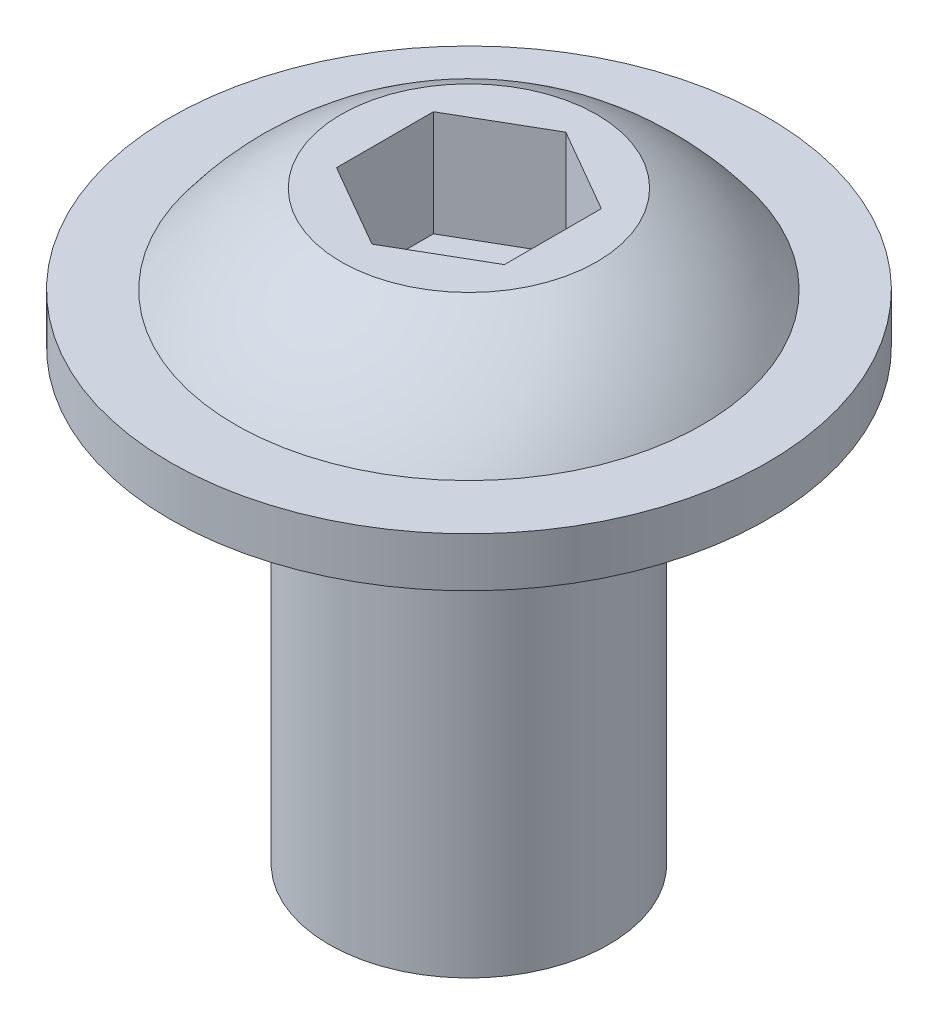
ISO-10303-21;
HEADER;
FILE_DESCRIPTION(('STEP AP214'),'2;1');
FILE_NAME('part.step','',(''),(''),'','','');
FILE_SCHEMA(('AUTOMOTIVE_DESIGN { 1 0 10303 214 1 1 1 1 }'));
ENDSEC;
DATA;
#1=APPLICATION_CONTEXT('core data for automotive mechanical design processes');
#2=APPLICATION_PROTOCOL_DEFINITION('international standard','automotive_design',2000,#1);
#3=PRODUCT_CONTEXT('',#1,'mechanical');
#4=PRODUCT('Part','Part','',(#3));
#5=PRODUCT_RELATED_PRODUCT_CATEGORY('part','',(#4));
#6=PRODUCT_DEFINITION_FORMATION('','',#4);
#7=PRODUCT_DEFINITION_CONTEXT('part definition',#1,'design');
#8=PRODUCT_DEFINITION('design','',#6,#7);
#9=PRODUCT_DEFINITION_SHAPE('','',#8);
#10=(LENGTH_UNIT() NAMED_UNIT(*) SI_UNIT(.MILLI.,.METRE.));
#11=(NAMED_UNIT(*) PLANE_ANGLE_UNIT() SI_UNIT($,.RADIAN.));
#12=(NAMED_UNIT(*) SI_UNIT($,.STERADIAN.) SOLID_ANGLE_UNIT());
#13=UNCERTAINTY_MEASURE_WITH_UNIT(LENGTH_MEASURE(1.E-05),#10,'distance_accuracy_value','');
#14=(GEOMETRIC_REPRESENTATION_CONTEXT(3) GLOBAL_UNCERTAINTY_ASSIGNED_CONTEXT((#13)) GLOBAL_UNIT_ASSIGNED_CONTEXT((#10,
#11,#12)) REPRESENTATION_CONTEXT('',''));
#15=CARTESIAN_POINT('',(0.,0.,0.));
#16=DIRECTION('',(0.,0.,1.));
#17=DIRECTION('',(1.,0.,0.));
#18=AXIS2_PLACEMENT_3D('',#15,#16,#17);
#19=CARTESIAN_POINT('',(0.,12.7,0.));
#20=DIRECTION('',(0.,-1.,0.));
#21=DIRECTION('',(0.,0.,-1.));
#22=AXIS2_PLACEMENT_3D('',#19,#20,#21);
#23=CYLINDRICAL_SURFACE('',#22,3.96875);
#24=CARTESIAN_POINT('',(0.,12.7,0.));
#25=DIRECTION('',(0.,1.,0.));
#26=DIRECTION('',(0.,0.,1.));
#27=AXIS2_PLACEMENT_3D('',#24,#25,#26);
#28=CIRCLE('',#27,3.96875);
#29=CARTESIAN_POINT('',(0.,12.7,3.96875));
#30=VERTEX_POINT('',#29);
#31=EDGE_CURVE('E40',#30,#30,#28,.T.);
#32=ORIENTED_EDGE('',*,*,#31,.F.);
#33=EDGE_LOOP('',(#32));
#34=FACE_BOUND('',#33,.T.);
#35=CARTESIAN_POINT('',(0.,0.,0.));
#36=DIRECTION('',(0.,1.,0.));
#37=DIRECTION('',(0.,0.,1.));
#38=AXIS2_PLACEMENT_3D('',#35,#36,#37);
#39=CIRCLE('',#38,3.96875);
#40=CARTESIAN_POINT('',(0.,0.,3.96875));
#41=VERTEX_POINT('',#40);
#42=EDGE_CURVE('E35',#41,#41,#39,.T.);
#43=ORIENTED_EDGE('',*,*,#42,.T.);
#44=EDGE_LOOP('',(#43));
#45=FACE_BOUND('',#44,.T.);
#46=ADVANCED_FACE('F32',(#34,#45),#23,.T.);
#47=CARTESIAN_POINT('',(0.,0.,0.));
#48=DIRECTION('',(0.,1.,0.));
#49=DIRECTION('',(0.,0.,1.));
#50=AXIS2_PLACEMENT_3D('',#47,#48,#49);
#51=PLANE('',#50);
#52=ORIENTED_EDGE('',*,*,#42,.F.);
#53=EDGE_LOOP('',(#52));
#54=FACE_BOUND('',#53,.T.);
#55=ADVANCED_FACE('F155',(#54),#51,.F.);
#56=CARTESIAN_POINT('',(0.,14.1,0.));
#57=DIRECTION('',(0.,-1.,0.));
#58=DIRECTION('',(0.,0.,-1.));
#59=AXIS2_PLACEMENT_3D('',#56,#57,#58);
#60=CYLINDRICAL_SURFACE('',#59,8.475);
#61=CARTESIAN_POINT('',(0.,14.1,0.));
#62=DIRECTION('',(0.,1.,0.));
#63=DIRECTION('',(0.,0.,1.));
#64=AXIS2_PLACEMENT_3D('',#61,#62,#63);
#65=CIRCLE('',#64,8.475);
#66=CARTESIAN_POINT('',(0.,14.1,8.475));
#67=VERTEX_POINT('',#66);
#68=EDGE_CURVE('E144',#67,#67,#65,.T.);
#69=ORIENTED_EDGE('',*,*,#68,.F.);
#70=EDGE_LOOP('',(#69));
#71=FACE_BOUND('',#70,.T.);
#72=CARTESIAN_POINT('',(0.,12.7,0.));
#73=DIRECTION('',(0.,1.,0.));
#74=DIRECTION('',(0.,0.,1.));
#75=AXIS2_PLACEMENT_3D('',#72,#73,#74);
#76=CIRCLE('',#75,8.475);
#77=CARTESIAN_POINT('',(0.,12.7,8.475));
#78=VERTEX_POINT('',#77);
#79=EDGE_CURVE('E143',#78,#78,#76,.T.);
#80=ORIENTED_EDGE('',*,*,#79,.T.);
#81=EDGE_LOOP('',(#80));
#82=FACE_BOUND('',#81,.T.);
#83=ADVANCED_FACE('F157',(#71,#82),#60,.T.);
#84=CARTESIAN_POINT('',(0.,14.1,0.));
#85=DIRECTION('',(0.,1.,0.));
#86=DIRECTION('',(0.,0.,1.));
#87=AXIS2_PLACEMENT_3D('',#84,#85,#86);
#88=PLANE('',#87);
#89=CARTESIAN_POINT('',(0.,14.1,0.));
#90=DIRECTION('',(0.,1.,0.));
#91=DIRECTION('',(-1.,0.,0.));
#92=AXIS2_PLACEMENT_3D('',#89,#90,#91);
#93=CIRCLE('',#92,6.625);
#94=CARTESIAN_POINT('',(-6.625,14.1,0.));
#95=VERTEX_POINT('',#94);
#96=EDGE_CURVE('E11',#95,#95,#93,.T.);
#97=ORIENTED_EDGE('',*,*,#96,.F.);
#98=EDGE_LOOP('',(#97));
#99=FACE_BOUND('',#98,.T.);
#100=ORIENTED_EDGE('',*,*,#68,.T.);
#101=EDGE_LOOP('',(#100));
#102=FACE_BOUND('',#101,.T.);
#103=ADVANCED_FACE('F162',(#99,#102),#88,.T.);
#104=CARTESIAN_POINT('',(0.,12.7,0.));
#105=DIRECTION('',(0.,1.,0.));
#106=DIRECTION('',(0.,0.,1.));
#107=AXIS2_PLACEMENT_3D('',#104,#105,#106);
#108=PLANE('',#107);
#109=ORIENTED_EDGE('',*,*,#31,.T.);
#110=EDGE_LOOP('',(#109));
#111=FACE_BOUND('',#110,.T.);
#112=ORIENTED_EDGE('',*,*,#79,.F.);
#113=EDGE_LOOP('',(#112));
#114=FACE_BOUND('',#113,.T.);
#115=ADVANCED_FACE('F167',(#111,#114),#108,.F.);
#116=CARTESIAN_POINT('',(0.,9.2,0.));
#117=DIRECTION('',(0.,1.,0.));
#118=DIRECTION('',(-1.,0.,0.));
#119=AXIS2_PLACEMENT_3D('',#116,#117,#118);
#120=SPHERICAL_SURFACE('',#119,8.24018355378082);
#121=ORIENTED_EDGE('',*,*,#96,.T.);
#122=EDGE_LOOP('',(#121));
#123=FACE_BOUND('',#122,.T.);
#124=CARTESIAN_POINT('',(0.,16.6,0.));
#125=DIRECTION('',(0.,1.,0.));
#126=DIRECTION('',(-1.,0.,0.));
#127=AXIS2_PLACEMENT_3D('',#124,#125,#126);
#128=CIRCLE('',#127,3.625);
#129=CARTESIAN_POINT('',(-3.625,16.6,0.));
#130=VERTEX_POINT('',#129);
#131=EDGE_CURVE('E135',#130,#130,#128,.T.);
#132=ORIENTED_EDGE('',*,*,#131,.F.);
#133=EDGE_LOOP('',(#132));
#134=FACE_BOUND('',#133,.T.);
#135=ADVANCED_FACE('F170',(#123,#134),#120,.T.);
#136=CARTESIAN_POINT('',(-3.625,16.6,0.));
#137=DIRECTION('',(0.,1.,0.));
#138=DIRECTION('',(-1.,0.,0.));
#139=AXIS2_PLACEMENT_3D('',#136,#137,#138);
#140=PLANE('',#139);
#141=DIRECTION('',(-0.866025403784439,0.,0.5));
#142=VECTOR('',#141,1.);
#143=CARTESIAN_POINT('',(0.,16.6,-2.74963065701559));
#144=LINE('',#143,#142);
#145=CARTESIAN_POINT('',(0.,16.6,-2.74963065701559));
#146=VERTEX_POINT('',#145);
#147=CARTESIAN_POINT('',(-2.38125,16.6,-1.3748153285078));
#148=VERTEX_POINT('',#147);
#149=EDGE_CURVE('E48',#146,#148,#144,.T.);
#150=ORIENTED_EDGE('',*,*,#149,.F.);
#151=DIRECTION('',(-0.866025403784439,0.,-0.5));
#152=VECTOR('',#151,1.);
#153=CARTESIAN_POINT('',(2.38125,16.6,-1.3748153285078));
#154=LINE('',#153,#152);
#155=CARTESIAN_POINT('',(2.38125,16.6,-1.3748153285078));
#156=VERTEX_POINT('',#155);
#157=EDGE_CURVE('E131',#156,#146,#154,.T.);
#158=ORIENTED_EDGE('',*,*,#157,.F.);
#159=DIRECTION('',(0.,0.,-1.));
#160=VECTOR('',#159,1.);
#161=CARTESIAN_POINT('',(2.38125,16.6,1.3748153285078));
#162=LINE('',#161,#160);
#163=CARTESIAN_POINT('',(2.38125,16.6,1.3748153285078));
#164=VERTEX_POINT('',#163);
#165=EDGE_CURVE('E129',#164,#156,#162,.T.);
#166=ORIENTED_EDGE('',*,*,#165,.F.);
#167=DIRECTION('',(0.866025403784438,0.,-0.5));
#168=VECTOR('',#167,1.);
#169=CARTESIAN_POINT('',(0.,16.6,2.74963065701559));
#170=LINE('',#169,#168);
#171=CARTESIAN_POINT('',(0.,16.6,2.74963065701559));
#172=VERTEX_POINT('',#171);
#173=EDGE_CURVE('E96',#172,#164,#170,.T.);
#174=ORIENTED_EDGE('',*,*,#173,.F.);
#175=DIRECTION('',(0.866025403784439,0.,0.5));
#176=VECTOR('',#175,1.);
#177=CARTESIAN_POINT('',(-2.38125,16.6,1.3748153285078));
#178=LINE('',#177,#176);
#179=CARTESIAN_POINT('',(-2.38125,16.6,1.3748153285078));
#180=VERTEX_POINT('',#179);
#181=EDGE_CURVE('E125',#180,#172,#178,.T.);
#182=ORIENTED_EDGE('',*,*,#181,.F.);
#183=DIRECTION('',(0.,0.,1.));
#184=VECTOR('',#183,1.);
#185=CARTESIAN_POINT('',(-2.38125,16.6,-1.3748153285078));
#186=LINE('',#185,#184);
#187=EDGE_CURVE('E122',#148,#180,#186,.T.);
#188=ORIENTED_EDGE('',*,*,#187,.F.);
#189=EDGE_LOOP('',(#150,#158,#166,#174,#182,#188));
#190=FACE_BOUND('',#189,.T.);
#191=ORIENTED_EDGE('',*,*,#131,.T.);
#192=EDGE_LOOP('',(#191));
#193=FACE_BOUND('',#192,.T.);
#194=ADVANCED_FACE('F176',(#190,#193),#140,.T.);
#195=CARTESIAN_POINT('',(0.,13.6,-2.74963065701559));
#196=DIRECTION('',(-0.5,0.,-0.866025403784439));
#197=DIRECTION('',(-0.866025403784439,0.,0.5));
#198=AXIS2_PLACEMENT_3D('',#195,#196,#197);
#199=PLANE('',#198);
#200=ORIENTED_EDGE('',*,*,#149,.T.);
#201=DIRECTION('',(0.,1.,0.));
#202=VECTOR('',#201,1.);
#203=CARTESIAN_POINT('',(-2.38125,13.6,-1.3748153285078));
#204=LINE('',#203,#202);
#205=CARTESIAN_POINT('',(-2.38125,13.6,-1.3748153285078));
#206=VERTEX_POINT('',#205);
#207=EDGE_CURVE('E78',#206,#148,#204,.T.);
#208=ORIENTED_EDGE('',*,*,#207,.F.);
#209=DIRECTION('',(-0.866025403784439,0.,0.5));
#210=VECTOR('',#209,1.);
#211=CARTESIAN_POINT('',(0.,13.6,-2.74963065701559));
#212=LINE('',#211,#210);
#213=CARTESIAN_POINT('',(0.,13.6,-2.74963065701559));
#214=VERTEX_POINT('',#213);
#215=EDGE_CURVE('E133',#214,#206,#212,.T.);
#216=ORIENTED_EDGE('',*,*,#215,.F.);
#217=DIRECTION('',(0.,1.,0.));
#218=VECTOR('',#217,1.);
#219=CARTESIAN_POINT('',(0.,13.6,-2.74963065701559));
#220=LINE('',#219,#218);
#221=EDGE_CURVE('E56',#214,#146,#220,.T.);
#222=ORIENTED_EDGE('',*,*,#221,.T.);
#223=EDGE_LOOP('',(#200,#208,#216,#222));
#224=FACE_BOUND('',#223,.T.);
#225=ADVANCED_FACE('F180',(#224),#199,.F.);
#226=CARTESIAN_POINT('',(2.38125,13.6,-1.3748153285078));
#227=DIRECTION('',(0.5,0.,-0.866025403784439));
#228=DIRECTION('',(-0.866025403784439,0.,-0.5));
#229=AXIS2_PLACEMENT_3D('',#226,#227,#228);
#230=PLANE('',#229);
#231=ORIENTED_EDGE('',*,*,#157,.T.);
#232=ORIENTED_EDGE('',*,*,#221,.F.);
#233=DIRECTION('',(-0.866025403784439,0.,-0.5));
#234=VECTOR('',#233,1.);
#235=CARTESIAN_POINT('',(2.38125,13.6,-1.3748153285078));
#236=LINE('',#235,#234);
#237=CARTESIAN_POINT('',(2.38125,13.6,-1.3748153285078));
#238=VERTEX_POINT('',#237);
#239=EDGE_CURVE('E108',#238,#214,#236,.T.);
#240=ORIENTED_EDGE('',*,*,#239,.F.);
#241=DIRECTION('',(0.,1.,0.));
#242=VECTOR('',#241,1.);
#243=CARTESIAN_POINT('',(2.38125,13.6,-1.3748153285078));
#244=LINE('',#243,#242);
#245=EDGE_CURVE('E100',#238,#156,#244,.T.);
#246=ORIENTED_EDGE('',*,*,#245,.T.);
#247=EDGE_LOOP('',(#231,#232,#240,#246));
#248=FACE_BOUND('',#247,.T.);
#249=ADVANCED_FACE('F184',(#248),#230,.F.);
#250=CARTESIAN_POINT('',(2.38125,13.6,1.3748153285078));
#251=DIRECTION('',(1.,0.,0.));
#252=DIRECTION('',(0.,1.,0.));
#253=AXIS2_PLACEMENT_3D('',#250,#251,#252);
#254=PLANE('',#253);
#255=ORIENTED_EDGE('',*,*,#165,.T.);
#256=ORIENTED_EDGE('',*,*,#245,.F.);
#257=DIRECTION('',(0.,0.,-1.));
#258=VECTOR('',#257,1.);
#259=CARTESIAN_POINT('',(2.38125,13.6,1.3748153285078));
#260=LINE('',#259,#258);
#261=CARTESIAN_POINT('',(2.38125,13.6,1.3748153285078));
#262=VERTEX_POINT('',#261);
#263=EDGE_CURVE('E104',#262,#238,#260,.T.);
#264=ORIENTED_EDGE('',*,*,#263,.F.);
#265=DIRECTION('',(0.,1.,0.));
#266=VECTOR('',#265,1.);
#267=CARTESIAN_POINT('',(2.38125,13.6,1.3748153285078));
#268=LINE('',#267,#266);
#269=EDGE_CURVE('E89',#262,#164,#268,.T.);
#270=ORIENTED_EDGE('',*,*,#269,.T.);
#271=EDGE_LOOP('',(#255,#256,#264,#270));
#272=FACE_BOUND('',#271,.T.);
#273=ADVANCED_FACE('F105',(#272),#254,.F.);
#274=CARTESIAN_POINT('',(0.,13.6,2.74963065701559));
#275=DIRECTION('',(0.5,0.,0.866025403784439));
#276=DIRECTION('',(0.866025403784439,0.,-0.5));
#277=AXIS2_PLACEMENT_3D('',#274,#275,#276);
#278=PLANE('',#277);
#279=ORIENTED_EDGE('',*,*,#173,.T.);
#280=ORIENTED_EDGE('',*,*,#269,.F.);
#281=DIRECTION('',(0.866025403784438,0.,-0.5));
#282=VECTOR('',#281,1.);
#283=CARTESIAN_POINT('',(0.,13.6,2.74963065701559));
#284=LINE('',#283,#282);
#285=CARTESIAN_POINT('',(0.,13.6,2.74963065701559));
#286=VERTEX_POINT('',#285);
#287=EDGE_CURVE('E93',#286,#262,#284,.T.);
#288=ORIENTED_EDGE('',*,*,#287,.F.);
#289=DIRECTION('',(0.,1.,0.));
#290=VECTOR('',#289,1.);
#291=CARTESIAN_POINT('',(0.,13.6,2.74963065701559));
#292=LINE('',#291,#290);
#293=EDGE_CURVE('E101',#286,#172,#292,.T.);
#294=ORIENTED_EDGE('',*,*,#293,.T.);
#295=EDGE_LOOP('',(#279,#280,#288,#294));
#296=FACE_BOUND('',#295,.T.);
#297=ADVANCED_FACE('F91',(#296),#278,.F.);
#298=CARTESIAN_POINT('',(-2.38125,13.6,1.3748153285078));
#299=DIRECTION('',(-0.5,0.,0.866025403784439));
#300=DIRECTION('',(0.866025403784439,0.,0.5));
#301=AXIS2_PLACEMENT_3D('',#298,#299,#300);
#302=PLANE('',#301);
#303=ORIENTED_EDGE('',*,*,#181,.T.);
#304=ORIENTED_EDGE('',*,*,#293,.F.);
#305=DIRECTION('',(0.866025403784439,0.,0.5));
#306=VECTOR('',#305,1.);
#307=CARTESIAN_POINT('',(-2.38125,13.6,1.3748153285078));
#308=LINE('',#307,#306);
#309=CARTESIAN_POINT('',(-2.38125,13.6,1.3748153285078));
#310=VERTEX_POINT('',#309);
#311=EDGE_CURVE('E114',#310,#286,#308,.T.);
#312=ORIENTED_EDGE('',*,*,#311,.F.);
#313=DIRECTION('',(0.,1.,0.));
#314=VECTOR('',#313,1.);
#315=CARTESIAN_POINT('',(-2.38125,13.6,1.3748153285078));
#316=LINE('',#315,#314);
#317=EDGE_CURVE('E138',#310,#180,#316,.T.);
#318=ORIENTED_EDGE('',*,*,#317,.T.);
#319=EDGE_LOOP('',(#303,#304,#312,#318));
#320=FACE_BOUND('',#319,.T.);
#321=ADVANCED_FACE('F188',(#320),#302,.F.);
#322=CARTESIAN_POINT('',(-2.38125,13.6,-1.3748153285078));
#323=DIRECTION('',(-1.,0.,0.));
#324=DIRECTION('',(0.,0.,1.));
#325=AXIS2_PLACEMENT_3D('',#322,#323,#324);
#326=PLANE('',#325);
#327=ORIENTED_EDGE('',*,*,#187,.T.);
#328=ORIENTED_EDGE('',*,*,#317,.F.);
#329=DIRECTION('',(0.,0.,1.));
#330=VECTOR('',#329,1.);
#331=CARTESIAN_POINT('',(-2.38125,13.6,-1.3748153285078));
#332=LINE('',#331,#330);
#333=EDGE_CURVE('E116',#206,#310,#332,.T.);
#334=ORIENTED_EDGE('',*,*,#333,.F.);
#335=ORIENTED_EDGE('',*,*,#207,.T.);
#336=EDGE_LOOP('',(#327,#328,#334,#335));
#337=FACE_BOUND('',#336,.T.);
#338=ADVANCED_FACE('F185',(#337),#326,.F.);
#339=CARTESIAN_POINT('',(0.,13.6,0.));
#340=DIRECTION('',(0.,1.,0.));
#341=DIRECTION('',(0.,0.,1.));
#342=AXIS2_PLACEMENT_3D('',#339,#340,#341);
#343=PLANE('',#342);
#344=ORIENTED_EDGE('',*,*,#215,.T.);
#345=ORIENTED_EDGE('',*,*,#333,.T.);
#346=ORIENTED_EDGE('',*,*,#311,.T.);
#347=ORIENTED_EDGE('',*,*,#287,.T.);
#348=ORIENTED_EDGE('',*,*,#263,.T.);
#349=ORIENTED_EDGE('',*,*,#239,.T.);
#350=EDGE_LOOP('',(#344,#345,#346,#347,#348,#349));
#351=FACE_BOUND('',#350,.T.);
#352=ADVANCED_FACE('F111',(#351),#343,.T.);
#353=CLOSED_SHELL('',(#46,#55,#83,#103,#115,#135,#194,#225,#249,#273,#297,#321,#338,#352));
#354=MANIFOLD_SOLID_BREP('B2',#353);
#355=ADVANCED_BREP_SHAPE_REPRESENTATION('',(#18,#354),#14);
#356=SHAPE_DEFINITION_REPRESENTATION(#9,#355);
ENDSEC;
END-ISO-10303-21;
